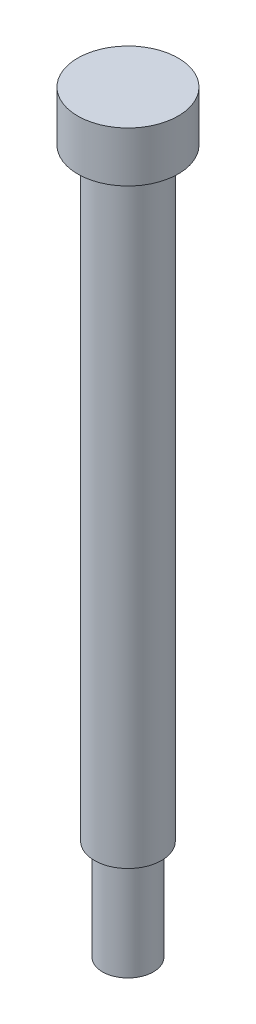
ISO-10303-21;
HEADER;
FILE_DESCRIPTION(('STEP AP214'),'2;1');
FILE_NAME('part.step','',(''),(''),'','','');
FILE_SCHEMA(('AUTOMOTIVE_DESIGN { 1 0 10303 214 1 1 1 1 }'));
ENDSEC;
DATA;
#1=APPLICATION_CONTEXT('core data for automotive mechanical design processes');
#2=APPLICATION_PROTOCOL_DEFINITION('international standard','automotive_design',2000,#1);
#3=PRODUCT_CONTEXT('',#1,'mechanical');
#4=PRODUCT('Part','Part','',(#3));
#5=PRODUCT_RELATED_PRODUCT_CATEGORY('part','',(#4));
#6=PRODUCT_DEFINITION_FORMATION('','',#4);
#7=PRODUCT_DEFINITION_CONTEXT('part definition',#1,'design');
#8=PRODUCT_DEFINITION('design','',#6,#7);
#9=PRODUCT_DEFINITION_SHAPE('','',#8);
#10=(LENGTH_UNIT() NAMED_UNIT(*) SI_UNIT(.MILLI.,.METRE.));
#11=(NAMED_UNIT(*) PLANE_ANGLE_UNIT() SI_UNIT($,.RADIAN.));
#12=(NAMED_UNIT(*) SI_UNIT($,.STERADIAN.) SOLID_ANGLE_UNIT());
#13=UNCERTAINTY_MEASURE_WITH_UNIT(LENGTH_MEASURE(1.E-05),#10,'distance_accuracy_value','');
#14=(GEOMETRIC_REPRESENTATION_CONTEXT(3) GLOBAL_UNCERTAINTY_ASSIGNED_CONTEXT((#13)) GLOBAL_UNIT_ASSIGNED_CONTEXT((#10,
#11,#12)) REPRESENTATION_CONTEXT('',''));
#15=CARTESIAN_POINT('',(0.,0.,0.));
#16=DIRECTION('',(0.,0.,1.));
#17=DIRECTION('',(1.,0.,0.));
#18=AXIS2_PLACEMENT_3D('',#15,#16,#17);
#19=CARTESIAN_POINT('',(0.,4.7625,0.));
#20=DIRECTION('',(0.,-1.,0.));
#21=DIRECTION('',(0.,0.,-1.));
#22=AXIS2_PLACEMENT_3D('',#19,#20,#21);
#23=PLANE('',#22);
#24=CARTESIAN_POINT('',(0.,4.7625,0.));
#25=DIRECTION('',(0.,1.,0.));
#26=DIRECTION('',(0.,0.,1.));
#27=AXIS2_PLACEMENT_3D('',#24,#25,#26);
#28=CIRCLE('',#27,4.7625);
#29=CARTESIAN_POINT('',(0.,4.7625,4.7625));
#30=VERTEX_POINT('',#29);
#31=EDGE_CURVE('E10',#30,#30,#28,.T.);
#32=ORIENTED_EDGE('',*,*,#31,.T.);
#33=EDGE_LOOP('',(#32));
#34=FACE_BOUND('',#33,.T.);
#35=ADVANCED_FACE('F31',(#34),#23,.F.);
#36=CARTESIAN_POINT('',(0.,24.8323599523242,0.));
#37=DIRECTION('',(0.,1.,0.));
#38=DIRECTION('',(0.,0.,1.));
#39=AXIS2_PLACEMENT_3D('',#36,#37,#38);
#40=CYLINDRICAL_SURFACE('',#39,4.7625);
#41=ORIENTED_EDGE('',*,*,#31,.F.);
#42=EDGE_LOOP('',(#41));
#43=FACE_BOUND('',#42,.T.);
#44=CARTESIAN_POINT('',(0.,0.,0.));
#45=DIRECTION('',(0.,1.,0.));
#46=DIRECTION('',(0.,0.,1.));
#47=AXIS2_PLACEMENT_3D('',#44,#45,#46);
#48=CIRCLE('',#47,4.7625);
#49=CARTESIAN_POINT('',(0.,0.,4.7625));
#50=VERTEX_POINT('',#49);
#51=EDGE_CURVE('E37',#50,#50,#48,.T.);
#52=ORIENTED_EDGE('',*,*,#51,.T.);
#53=EDGE_LOOP('',(#52));
#54=FACE_BOUND('',#53,.T.);
#55=ADVANCED_FACE('F69',(#43,#54),#40,.T.);
#56=CARTESIAN_POINT('',(4.7625,0.,0.));
#57=DIRECTION('',(0.,1.,0.));
#58=DIRECTION('',(0.,0.,1.));
#59=AXIS2_PLACEMENT_3D('',#56,#57,#58);
#60=PLANE('',#59);
#61=ORIENTED_EDGE('',*,*,#51,.F.);
#62=EDGE_LOOP('',(#61));
#63=FACE_BOUND('',#62,.T.);
#64=CARTESIAN_POINT('',(0.,0.,0.));
#65=DIRECTION('',(0.,1.,0.));
#66=DIRECTION('',(0.,0.,1.));
#67=AXIS2_PLACEMENT_3D('',#64,#65,#66);
#68=CIRCLE('',#67,3.175);
#69=CARTESIAN_POINT('',(0.,0.,3.175));
#70=VERTEX_POINT('',#69);
#71=EDGE_CURVE('E41',#70,#70,#68,.T.);
#72=ORIENTED_EDGE('',*,*,#71,.T.);
#73=EDGE_LOOP('',(#72));
#74=FACE_BOUND('',#73,.T.);
#75=ADVANCED_FACE('F73',(#63,#74),#60,.F.);
#76=CARTESIAN_POINT('',(0.,24.8323599523242,0.));
#77=DIRECTION('',(0.,1.,0.));
#78=DIRECTION('',(0.,0.,1.));
#79=AXIS2_PLACEMENT_3D('',#76,#77,#78);
#80=CYLINDRICAL_SURFACE('',#79,3.17500000000001);
#81=ORIENTED_EDGE('',*,*,#71,.F.);
#82=EDGE_LOOP('',(#81));
#83=FACE_BOUND('',#82,.T.);
#84=CARTESIAN_POINT('',(0.,-57.15,0.));
#85=DIRECTION('',(0.,1.,0.));
#86=DIRECTION('',(0.,0.,1.));
#87=AXIS2_PLACEMENT_3D('',#84,#85,#86);
#88=CIRCLE('',#87,3.17500000000001);
#89=CARTESIAN_POINT('',(0.,-57.15,3.17500000000001));
#90=VERTEX_POINT('',#89);
#91=EDGE_CURVE('E45',#90,#90,#88,.T.);
#92=ORIENTED_EDGE('',*,*,#91,.T.);
#93=EDGE_LOOP('',(#92));
#94=FACE_BOUND('',#93,.T.);
#95=ADVANCED_FACE('F78',(#83,#94),#80,.T.);
#96=CARTESIAN_POINT('',(3.17500000000001,-57.15,0.));
#97=DIRECTION('',(0.,1.,0.));
#98=DIRECTION('',(0.,0.,1.));
#99=AXIS2_PLACEMENT_3D('',#96,#97,#98);
#100=PLANE('',#99);
#101=ORIENTED_EDGE('',*,*,#91,.F.);
#102=EDGE_LOOP('',(#101));
#103=FACE_BOUND('',#102,.T.);
#104=CARTESIAN_POINT('',(0.,-57.15,0.));
#105=DIRECTION('',(0.,1.,0.));
#106=DIRECTION('',(0.,0.,1.));
#107=AXIS2_PLACEMENT_3D('',#104,#105,#106);
#108=CIRCLE('',#107,2.41300000000001);
#109=CARTESIAN_POINT('',(0.,-57.15,2.41300000000001));
#110=VERTEX_POINT('',#109);
#111=EDGE_CURVE('E50',#110,#110,#108,.T.);
#112=ORIENTED_EDGE('',*,*,#111,.T.);
#113=EDGE_LOOP('',(#112));
#114=FACE_BOUND('',#113,.T.);
#115=ADVANCED_FACE('F65',(#103,#114),#100,.F.);
#116=CARTESIAN_POINT('',(0.,24.8323599523242,0.));
#117=DIRECTION('',(0.,1.,0.));
#118=DIRECTION('',(0.,0.,1.));
#119=AXIS2_PLACEMENT_3D('',#116,#117,#118);
#120=CYLINDRICAL_SURFACE('',#119,2.41300000000001);
#121=ORIENTED_EDGE('',*,*,#111,.F.);
#122=EDGE_LOOP('',(#121));
#123=FACE_BOUND('',#122,.T.);
#124=CARTESIAN_POINT('',(0.,-66.675,0.));
#125=DIRECTION('',(0.,1.,0.));
#126=DIRECTION('',(0.,0.,1.));
#127=AXIS2_PLACEMENT_3D('',#124,#125,#126);
#128=CIRCLE('',#127,2.41300000000001);
#129=CARTESIAN_POINT('',(0.,-66.675,2.41300000000001));
#130=VERTEX_POINT('',#129);
#131=EDGE_CURVE('E53',#130,#130,#128,.T.);
#132=ORIENTED_EDGE('',*,*,#131,.T.);
#133=EDGE_LOOP('',(#132));
#134=FACE_BOUND('',#133,.T.);
#135=ADVANCED_FACE('F57',(#123,#134),#120,.T.);
#136=CARTESIAN_POINT('',(2.41300000000001,-66.675,0.));
#137=DIRECTION('',(0.,1.,0.));
#138=DIRECTION('',(0.,0.,1.));
#139=AXIS2_PLACEMENT_3D('',#136,#137,#138);
#140=PLANE('',#139);
#141=ORIENTED_EDGE('',*,*,#131,.F.);
#142=EDGE_LOOP('',(#141));
#143=FACE_BOUND('',#142,.T.);
#144=ADVANCED_FACE('F59',(#143),#140,.F.);
#145=CLOSED_SHELL('',(#35,#55,#75,#95,#115,#135,#144));
#146=MANIFOLD_SOLID_BREP('B2',#145);
#147=ADVANCED_BREP_SHAPE_REPRESENTATION('',(#18,#146),#14);
#148=SHAPE_DEFINITION_REPRESENTATION(#9,#147);
ENDSEC;
END-ISO-10303-21;
